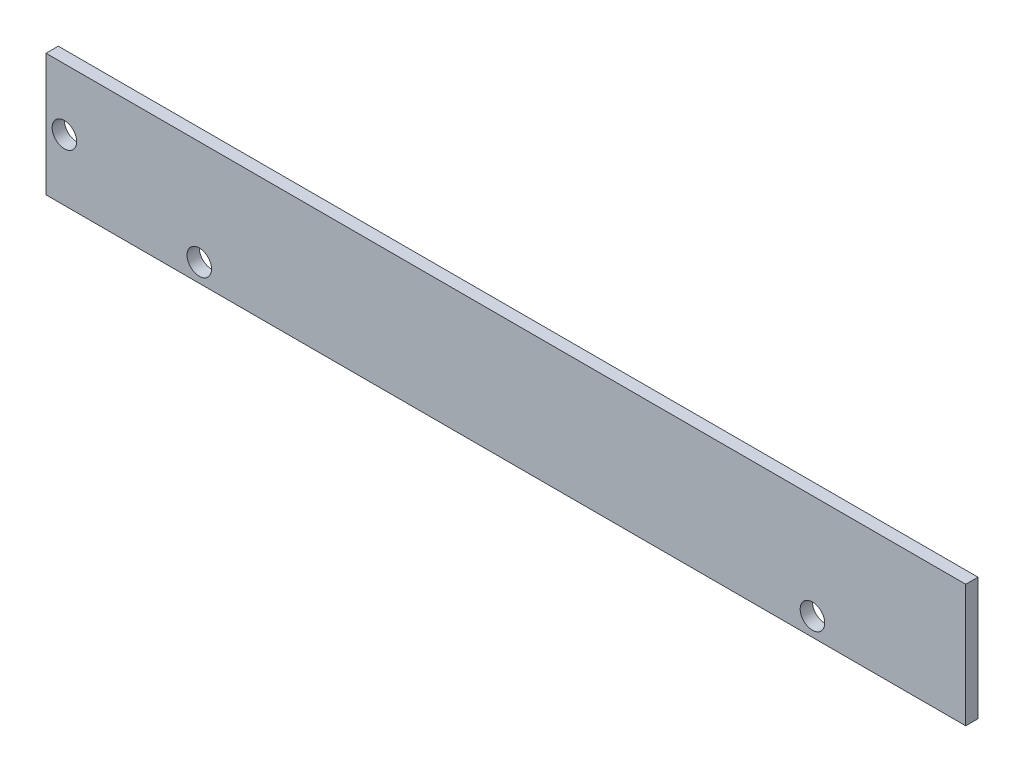
ISO-10303-21;
HEADER;
FILE_DESCRIPTION(('STEP AP214'),'2;1');
FILE_NAME('part.step','',(''),(''),'','','');
FILE_SCHEMA(('AUTOMOTIVE_DESIGN { 1 0 10303 214 1 1 1 1 }'));
ENDSEC;
DATA;
#1=APPLICATION_CONTEXT('core data for automotive mechanical design processes');
#2=APPLICATION_PROTOCOL_DEFINITION('international standard','automotive_design',2000,#1);
#3=PRODUCT_CONTEXT('',#1,'mechanical');
#4=PRODUCT('Part','Part','',(#3));
#5=PRODUCT_RELATED_PRODUCT_CATEGORY('part','',(#4));
#6=PRODUCT_DEFINITION_FORMATION('','',#4);
#7=PRODUCT_DEFINITION_CONTEXT('part definition',#1,'design');
#8=PRODUCT_DEFINITION('design','',#6,#7);
#9=PRODUCT_DEFINITION_SHAPE('','',#8);
#10=(LENGTH_UNIT() NAMED_UNIT(*) SI_UNIT(.MILLI.,.METRE.));
#11=(NAMED_UNIT(*) PLANE_ANGLE_UNIT() SI_UNIT($,.RADIAN.));
#12=(NAMED_UNIT(*) SI_UNIT($,.STERADIAN.) SOLID_ANGLE_UNIT());
#13=UNCERTAINTY_MEASURE_WITH_UNIT(LENGTH_MEASURE(1.E-05),#10,'distance_accuracy_value','');
#14=(GEOMETRIC_REPRESENTATION_CONTEXT(3) GLOBAL_UNCERTAINTY_ASSIGNED_CONTEXT((#13)) GLOBAL_UNIT_ASSIGNED_CONTEXT((#10,
#11,#12)) REPRESENTATION_CONTEXT('',''));
#15=CARTESIAN_POINT('',(0.,0.,0.));
#16=DIRECTION('',(0.,0.,1.));
#17=DIRECTION('',(1.,0.,0.));
#18=AXIS2_PLACEMENT_3D('',#15,#16,#17);
#19=CARTESIAN_POINT('',(0.,10.,2.));
#20=DIRECTION('',(0.,1.,0.));
#21=DIRECTION('',(0.,0.,1.));
#22=AXIS2_PLACEMENT_3D('',#19,#20,#21);
#23=PLANE('',#22);
#24=DIRECTION('',(1.,0.,0.));
#25=VECTOR('',#24,1.);
#26=CARTESIAN_POINT('',(0.,10.,0.));
#27=LINE('',#26,#25);
#28=CARTESIAN_POINT('',(-75.,10.,0.));
#29=VERTEX_POINT('',#28);
#30=CARTESIAN_POINT('',(75.,10.,0.));
#31=VERTEX_POINT('',#30);
#32=EDGE_CURVE('E103',#29,#31,#27,.T.);
#33=ORIENTED_EDGE('',*,*,#32,.F.);
#34=DIRECTION('',(0.,0.,-1.));
#35=VECTOR('',#34,1.);
#36=CARTESIAN_POINT('',(-75.,10.,2.));
#37=LINE('',#36,#35);
#38=CARTESIAN_POINT('',(-75.,10.,2.));
#39=VERTEX_POINT('',#38);
#40=EDGE_CURVE('E11',#39,#29,#37,.T.);
#41=ORIENTED_EDGE('',*,*,#40,.F.);
#42=DIRECTION('',(1.,0.,0.));
#43=VECTOR('',#42,1.);
#44=CARTESIAN_POINT('',(0.,10.,2.));
#45=LINE('',#44,#43);
#46=CARTESIAN_POINT('',(75.,10.,2.));
#47=VERTEX_POINT('',#46);
#48=EDGE_CURVE('E87',#39,#47,#45,.T.);
#49=ORIENTED_EDGE('',*,*,#48,.T.);
#50=DIRECTION('',(0.,0.,-1.));
#51=VECTOR('',#50,1.);
#52=CARTESIAN_POINT('',(75.,10.,2.));
#53=LINE('',#52,#51);
#54=EDGE_CURVE('E49',#47,#31,#53,.T.);
#55=ORIENTED_EDGE('',*,*,#54,.T.);
#56=EDGE_LOOP('',(#33,#41,#49,#55));
#57=FACE_BOUND('',#56,.T.);
#58=ADVANCED_FACE('F32',(#57),#23,.T.);
#59=CARTESIAN_POINT('',(-75.,-117.846561430917,2.));
#60=DIRECTION('',(1.,0.,0.));
#61=DIRECTION('',(0.,0.,-1.));
#62=AXIS2_PLACEMENT_3D('',#59,#60,#61);
#63=PLANE('',#62);
#64=DIRECTION('',(0.,-1.,0.));
#65=VECTOR('',#64,1.);
#66=CARTESIAN_POINT('',(-75.,-117.846561430917,0.));
#67=LINE('',#66,#65);
#68=CARTESIAN_POINT('',(-75.,-9.99999999999999,0.));
#69=VERTEX_POINT('',#68);
#70=EDGE_CURVE('E92',#29,#69,#67,.T.);
#71=ORIENTED_EDGE('',*,*,#70,.T.);
#72=DIRECTION('',(0.,0.,-1.));
#73=VECTOR('',#72,1.);
#74=CARTESIAN_POINT('',(-75.,-9.99999999999999,2.));
#75=LINE('',#74,#73);
#76=CARTESIAN_POINT('',(-75.,-9.99999999999999,2.));
#77=VERTEX_POINT('',#76);
#78=EDGE_CURVE('E41',#77,#69,#75,.T.);
#79=ORIENTED_EDGE('',*,*,#78,.F.);
#80=DIRECTION('',(0.,-1.,0.));
#81=VECTOR('',#80,1.);
#82=CARTESIAN_POINT('',(-75.,-117.846561430917,2.));
#83=LINE('',#82,#81);
#84=EDGE_CURVE('E83',#39,#77,#83,.T.);
#85=ORIENTED_EDGE('',*,*,#84,.F.);
#86=ORIENTED_EDGE('',*,*,#40,.T.);
#87=EDGE_LOOP('',(#71,#79,#85,#86));
#88=FACE_BOUND('',#87,.T.);
#89=ADVANCED_FACE('F90',(#88),#63,.F.);
#90=CARTESIAN_POINT('',(0.,-9.99999999999999,2.));
#91=DIRECTION('',(0.,1.,0.));
#92=DIRECTION('',(0.,0.,1.));
#93=AXIS2_PLACEMENT_3D('',#90,#91,#92);
#94=PLANE('',#93);
#95=DIRECTION('',(1.,0.,0.));
#96=VECTOR('',#95,1.);
#97=CARTESIAN_POINT('',(0.,-9.99999999999999,0.));
#98=LINE('',#97,#96);
#99=CARTESIAN_POINT('',(75.,-9.99999999999999,0.));
#100=VERTEX_POINT('',#99);
#101=EDGE_CURVE('E100',#69,#100,#98,.T.);
#102=ORIENTED_EDGE('',*,*,#101,.T.);
#103=DIRECTION('',(0.,0.,-1.));
#104=VECTOR('',#103,1.);
#105=CARTESIAN_POINT('',(75.,-9.99999999999999,2.));
#106=LINE('',#105,#104);
#107=CARTESIAN_POINT('',(75.,-9.99999999999999,2.));
#108=VERTEX_POINT('',#107);
#109=EDGE_CURVE('E63',#108,#100,#106,.T.);
#110=ORIENTED_EDGE('',*,*,#109,.F.);
#111=DIRECTION('',(1.,0.,0.));
#112=VECTOR('',#111,1.);
#113=CARTESIAN_POINT('',(0.,-9.99999999999999,2.));
#114=LINE('',#113,#112);
#115=EDGE_CURVE('E75',#77,#108,#114,.T.);
#116=ORIENTED_EDGE('',*,*,#115,.F.);
#117=ORIENTED_EDGE('',*,*,#78,.T.);
#118=EDGE_LOOP('',(#102,#110,#116,#117));
#119=FACE_BOUND('',#118,.T.);
#120=ADVANCED_FACE('F77',(#119),#94,.F.);
#121=CARTESIAN_POINT('',(50.,-7.,2.));
#122=DIRECTION('',(0.,0.,-1.));
#123=DIRECTION('',(-1.,0.,0.));
#124=AXIS2_PLACEMENT_3D('',#121,#122,#123);
#125=CYLINDRICAL_SURFACE('',#124,2.);
#126=CARTESIAN_POINT('',(50.,-7.,2.));
#127=DIRECTION('',(0.,0.,1.));
#128=DIRECTION('',(1.,0.,0.));
#129=AXIS2_PLACEMENT_3D('',#126,#127,#128);
#130=CIRCLE('',#129,2.);
#131=CARTESIAN_POINT('',(52.,-7.,2.));
#132=VERTEX_POINT('',#131);
#133=EDGE_CURVE('E116',#132,#132,#130,.T.);
#134=ORIENTED_EDGE('',*,*,#133,.T.);
#135=EDGE_LOOP('',(#134));
#136=FACE_BOUND('',#135,.T.);
#137=CARTESIAN_POINT('',(50.,-7.,0.));
#138=DIRECTION('',(0.,0.,1.));
#139=DIRECTION('',(1.,0.,0.));
#140=AXIS2_PLACEMENT_3D('',#137,#138,#139);
#141=CIRCLE('',#140,2.);
#142=CARTESIAN_POINT('',(52.,-7.,0.));
#143=VERTEX_POINT('',#142);
#144=EDGE_CURVE('E105',#143,#143,#141,.T.);
#145=ORIENTED_EDGE('',*,*,#144,.F.);
#146=EDGE_LOOP('',(#145));
#147=FACE_BOUND('',#146,.T.);
#148=ADVANCED_FACE('F136',(#136,#147),#125,.F.);
#149=CARTESIAN_POINT('',(-50.,-7.,2.));
#150=DIRECTION('',(0.,0.,-1.));
#151=DIRECTION('',(-1.,0.,0.));
#152=AXIS2_PLACEMENT_3D('',#149,#150,#151);
#153=CYLINDRICAL_SURFACE('',#152,2.);
#154=CARTESIAN_POINT('',(-50.,-7.,2.));
#155=DIRECTION('',(0.,0.,1.));
#156=DIRECTION('',(1.,0.,0.));
#157=AXIS2_PLACEMENT_3D('',#154,#155,#156);
#158=CIRCLE('',#157,2.);
#159=CARTESIAN_POINT('',(-48.,-7.,2.));
#160=VERTEX_POINT('',#159);
#161=EDGE_CURVE('E119',#160,#160,#158,.T.);
#162=ORIENTED_EDGE('',*,*,#161,.T.);
#163=EDGE_LOOP('',(#162));
#164=FACE_BOUND('',#163,.T.);
#165=CARTESIAN_POINT('',(-50.,-7.,0.));
#166=DIRECTION('',(0.,0.,1.));
#167=DIRECTION('',(1.,0.,0.));
#168=AXIS2_PLACEMENT_3D('',#165,#166,#167);
#169=CIRCLE('',#168,2.);
#170=CARTESIAN_POINT('',(-48.,-7.,0.));
#171=VERTEX_POINT('',#170);
#172=EDGE_CURVE('E108',#171,#171,#169,.T.);
#173=ORIENTED_EDGE('',*,*,#172,.F.);
#174=EDGE_LOOP('',(#173));
#175=FACE_BOUND('',#174,.T.);
#176=ADVANCED_FACE('F139',(#164,#175),#153,.F.);
#177=CARTESIAN_POINT('',(-72.,0.,2.));
#178=DIRECTION('',(0.,0.,-1.));
#179=DIRECTION('',(-1.,0.,0.));
#180=AXIS2_PLACEMENT_3D('',#177,#178,#179);
#181=CYLINDRICAL_SURFACE('',#180,2.);
#182=CARTESIAN_POINT('',(-72.,0.,2.));
#183=DIRECTION('',(0.,0.,1.));
#184=DIRECTION('',(1.,0.,0.));
#185=AXIS2_PLACEMENT_3D('',#182,#183,#184);
#186=CIRCLE('',#185,2.);
#187=CARTESIAN_POINT('',(-70.,0.,2.));
#188=VERTEX_POINT('',#187);
#189=EDGE_CURVE('E99',#188,#188,#186,.T.);
#190=ORIENTED_EDGE('',*,*,#189,.T.);
#191=EDGE_LOOP('',(#190));
#192=FACE_BOUND('',#191,.T.);
#193=CARTESIAN_POINT('',(-72.,0.,0.));
#194=DIRECTION('',(0.,0.,1.));
#195=DIRECTION('',(1.,0.,0.));
#196=AXIS2_PLACEMENT_3D('',#193,#194,#195);
#197=CIRCLE('',#196,2.);
#198=CARTESIAN_POINT('',(-70.,0.,0.));
#199=VERTEX_POINT('',#198);
#200=EDGE_CURVE('E111',#199,#199,#197,.T.);
#201=ORIENTED_EDGE('',*,*,#200,.F.);
#202=EDGE_LOOP('',(#201));
#203=FACE_BOUND('',#202,.T.);
#204=ADVANCED_FACE('F34',(#192,#203),#181,.F.);
#205=CARTESIAN_POINT('',(75.,-117.846561430917,2.));
#206=DIRECTION('',(1.,0.,0.));
#207=DIRECTION('',(0.,0.,-1.));
#208=AXIS2_PLACEMENT_3D('',#205,#206,#207);
#209=PLANE('',#208);
#210=DIRECTION('',(0.,-1.,0.));
#211=VECTOR('',#210,1.);
#212=CARTESIAN_POINT('',(75.,-117.846561430917,0.));
#213=LINE('',#212,#211);
#214=EDGE_CURVE('E96',#31,#100,#213,.T.);
#215=ORIENTED_EDGE('',*,*,#214,.F.);
#216=ORIENTED_EDGE('',*,*,#54,.F.);
#217=DIRECTION('',(0.,-1.,0.));
#218=VECTOR('',#217,1.);
#219=CARTESIAN_POINT('',(75.,-117.846561430917,2.));
#220=LINE('',#219,#218);
#221=EDGE_CURVE('E82',#47,#108,#220,.T.);
#222=ORIENTED_EDGE('',*,*,#221,.T.);
#223=ORIENTED_EDGE('',*,*,#109,.T.);
#224=EDGE_LOOP('',(#215,#216,#222,#223));
#225=FACE_BOUND('',#224,.T.);
#226=ADVANCED_FACE('F130',(#225),#209,.T.);
#227=CARTESIAN_POINT('',(0.,-117.846561430917,2.));
#228=DIRECTION('',(0.,0.,1.));
#229=DIRECTION('',(1.,0.,0.));
#230=AXIS2_PLACEMENT_3D('',#227,#228,#229);
#231=PLANE('',#230);
#232=ORIENTED_EDGE('',*,*,#189,.F.);
#233=EDGE_LOOP('',(#232));
#234=FACE_BOUND('',#233,.T.);
#235=ORIENTED_EDGE('',*,*,#161,.F.);
#236=EDGE_LOOP('',(#235));
#237=FACE_BOUND('',#236,.T.);
#238=ORIENTED_EDGE('',*,*,#133,.F.);
#239=EDGE_LOOP('',(#238));
#240=FACE_BOUND('',#239,.T.);
#241=ORIENTED_EDGE('',*,*,#48,.F.);
#242=ORIENTED_EDGE('',*,*,#84,.T.);
#243=ORIENTED_EDGE('',*,*,#115,.T.);
#244=ORIENTED_EDGE('',*,*,#221,.F.);
#245=EDGE_LOOP('',(#241,#242,#243,#244));
#246=FACE_BOUND('',#245,.T.);
#247=ADVANCED_FACE('F86',(#234,#237,#240,#246),#231,.T.);
#248=CARTESIAN_POINT('',(0.,-117.846561430917,0.));
#249=DIRECTION('',(0.,0.,1.));
#250=DIRECTION('',(1.,0.,0.));
#251=AXIS2_PLACEMENT_3D('',#248,#249,#250);
#252=PLANE('',#251);
#253=ORIENTED_EDGE('',*,*,#200,.T.);
#254=EDGE_LOOP('',(#253));
#255=FACE_BOUND('',#254,.T.);
#256=ORIENTED_EDGE('',*,*,#172,.T.);
#257=EDGE_LOOP('',(#256));
#258=FACE_BOUND('',#257,.T.);
#259=ORIENTED_EDGE('',*,*,#144,.T.);
#260=EDGE_LOOP('',(#259));
#261=FACE_BOUND('',#260,.T.);
#262=ORIENTED_EDGE('',*,*,#32,.T.);
#263=ORIENTED_EDGE('',*,*,#214,.T.);
#264=ORIENTED_EDGE('',*,*,#101,.F.);
#265=ORIENTED_EDGE('',*,*,#70,.F.);
#266=EDGE_LOOP('',(#262,#263,#264,#265));
#267=FACE_BOUND('',#266,.T.);
#268=ADVANCED_FACE('F129',(#255,#258,#261,#267),#252,.F.);
#269=CLOSED_SHELL('',(#58,#89,#120,#148,#176,#204,#226,#247,#268));
#270=MANIFOLD_SOLID_BREP('B2',#269);
#271=ADVANCED_BREP_SHAPE_REPRESENTATION('',(#18,#270),#14);
#272=SHAPE_DEFINITION_REPRESENTATION(#9,#271);
ENDSEC;
END-ISO-10303-21;
